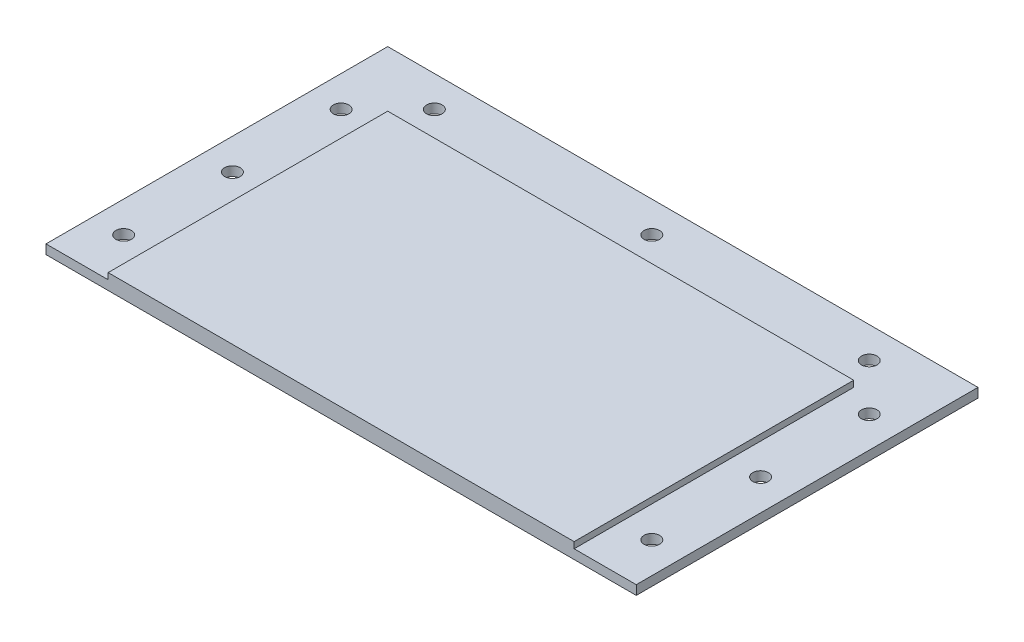
ISO-10303-21;
HEADER;
FILE_DESCRIPTION(('STEP AP214'),'2;1');
FILE_NAME('part.step','',(''),(''),'','','');
FILE_SCHEMA(('AUTOMOTIVE_DESIGN { 1 0 10303 214 1 1 1 1 }'));
ENDSEC;
DATA;
#1=APPLICATION_CONTEXT('core data for automotive mechanical design processes');
#2=APPLICATION_PROTOCOL_DEFINITION('international standard','automotive_design',2000,#1);
#3=PRODUCT_CONTEXT('',#1,'mechanical');
#4=PRODUCT('Part','Part','',(#3));
#5=PRODUCT_RELATED_PRODUCT_CATEGORY('part','',(#4));
#6=PRODUCT_DEFINITION_FORMATION('','',#4);
#7=PRODUCT_DEFINITION_CONTEXT('part definition',#1,'design');
#8=PRODUCT_DEFINITION('design','',#6,#7);
#9=PRODUCT_DEFINITION_SHAPE('','',#8);
#10=(LENGTH_UNIT() NAMED_UNIT(*) SI_UNIT(.MILLI.,.METRE.));
#11=(NAMED_UNIT(*) PLANE_ANGLE_UNIT() SI_UNIT($,.RADIAN.));
#12=(NAMED_UNIT(*) SI_UNIT($,.STERADIAN.) SOLID_ANGLE_UNIT());
#13=UNCERTAINTY_MEASURE_WITH_UNIT(LENGTH_MEASURE(1.E-05),#10,'distance_accuracy_value','');
#14=(GEOMETRIC_REPRESENTATION_CONTEXT(3) GLOBAL_UNCERTAINTY_ASSIGNED_CONTEXT((#13)) GLOBAL_UNIT_ASSIGNED_CONTEXT((#10,
#11,#12)) REPRESENTATION_CONTEXT('',''));
#15=CARTESIAN_POINT('',(0.,0.,0.));
#16=DIRECTION('',(0.,0.,1.));
#17=DIRECTION('',(1.,0.,0.));
#18=AXIS2_PLACEMENT_3D('',#15,#16,#17);
#19=CARTESIAN_POINT('',(0.,0.,0.));
#20=DIRECTION('',(0.,1.,0.));
#21=DIRECTION('',(0.,0.,1.));
#22=AXIS2_PLACEMENT_3D('',#19,#20,#21);
#23=PLANE('',#22);
#24=CARTESIAN_POINT('',(70.0000000000004,0.,-54.9999999999994));
#25=DIRECTION('',(0.,-1.,0.));
#26=DIRECTION('',(0.,0.,-1.));
#27=AXIS2_PLACEMENT_3D('',#24,#25,#26);
#28=CIRCLE('',#27,2.49999999999952);
#29=CARTESIAN_POINT('',(70.0000000000004,0.,-57.4999999999989));
#30=VERTEX_POINT('',#29);
#31=EDGE_CURVE('E317',#30,#30,#28,.T.);
#32=ORIENTED_EDGE('',*,*,#31,.F.);
#33=EDGE_LOOP('',(#32));
#34=FACE_BOUND('',#33,.T.);
#35=CARTESIAN_POINT('',(-84.9999999999994,0.,-39.9999999999999));
#36=DIRECTION('',(0.,-1.,0.));
#37=DIRECTION('',(0.,0.,-1.));
#38=AXIS2_PLACEMENT_3D('',#35,#36,#37);
#39=CIRCLE('',#38,2.50000000000001);
#40=CARTESIAN_POINT('',(-84.9999999999994,0.,-42.4999999999999));
#41=VERTEX_POINT('',#40);
#42=EDGE_CURVE('E320',#41,#41,#39,.T.);
#43=ORIENTED_EDGE('',*,*,#42,.F.);
#44=EDGE_LOOP('',(#43));
#45=FACE_BOUND('',#44,.T.);
#46=CARTESIAN_POINT('',(-84.9999999999998,0.,-4.99999999999999));
#47=DIRECTION('',(0.,-1.,0.));
#48=DIRECTION('',(0.,0.,-1.));
#49=AXIS2_PLACEMENT_3D('',#46,#47,#48);
#50=CIRCLE('',#49,2.50000000000001);
#51=CARTESIAN_POINT('',(-84.9999999999998,0.,-7.5));
#52=VERTEX_POINT('',#51);
#53=EDGE_CURVE('E306',#52,#52,#50,.T.);
#54=ORIENTED_EDGE('',*,*,#53,.F.);
#55=EDGE_LOOP('',(#54));
#56=FACE_BOUND('',#55,.T.);
#57=CARTESIAN_POINT('',(-84.9999999999999,0.,30.));
#58=DIRECTION('',(0.,-1.,0.));
#59=DIRECTION('',(0.,0.,-1.));
#60=AXIS2_PLACEMENT_3D('',#57,#58,#59);
#61=CIRCLE('',#60,2.5);
#62=CARTESIAN_POINT('',(-84.9999999999999,0.,27.5));
#63=VERTEX_POINT('',#62);
#64=EDGE_CURVE('E302',#63,#63,#61,.T.);
#65=ORIENTED_EDGE('',*,*,#64,.F.);
#66=EDGE_LOOP('',(#65));
#67=FACE_BOUND('',#66,.T.);
#68=CARTESIAN_POINT('',(7.21644966006352E-13,0.,-54.9999999999993));
#69=DIRECTION('',(0.,-1.,0.));
#70=DIRECTION('',(0.,0.,-1.));
#71=AXIS2_PLACEMENT_3D('',#68,#69,#70);
#72=CIRCLE('',#71,2.50000000000001);
#73=CARTESIAN_POINT('',(7.21644966006352E-13,0.,-57.4999999999993));
#74=VERTEX_POINT('',#73);
#75=EDGE_CURVE('E300',#74,#74,#72,.T.);
#76=ORIENTED_EDGE('',*,*,#75,.F.);
#77=EDGE_LOOP('',(#76));
#78=FACE_BOUND('',#77,.T.);
#79=CARTESIAN_POINT('',(-69.9999999999993,0.,-55.0000000000004));
#80=DIRECTION('',(0.,-1.,0.));
#81=DIRECTION('',(0.,0.,-1.));
#82=AXIS2_PLACEMENT_3D('',#79,#80,#81);
#83=CIRCLE('',#82,2.5);
#84=CARTESIAN_POINT('',(-69.9999999999993,0.,-57.5000000000004));
#85=VERTEX_POINT('',#84);
#86=EDGE_CURVE('E303',#85,#85,#83,.T.);
#87=ORIENTED_EDGE('',*,*,#86,.F.);
#88=EDGE_LOOP('',(#87));
#89=FACE_BOUND('',#88,.T.);
#90=CARTESIAN_POINT('',(85.0000000000004,0.,-5.));
#91=DIRECTION('',(0.,-1.,0.));
#92=DIRECTION('',(0.,0.,-1.));
#93=AXIS2_PLACEMENT_3D('',#90,#91,#92);
#94=CIRCLE('',#93,2.50000000000001);
#95=CARTESIAN_POINT('',(85.0000000000004,0.,-7.50000000000001));
#96=VERTEX_POINT('',#95);
#97=EDGE_CURVE('E309',#96,#96,#94,.T.);
#98=ORIENTED_EDGE('',*,*,#97,.F.);
#99=EDGE_LOOP('',(#98));
#100=FACE_BOUND('',#99,.T.);
#101=CARTESIAN_POINT('',(85.,0.,-40.));
#102=DIRECTION('',(0.,-1.,0.));
#103=DIRECTION('',(0.,0.,-1.));
#104=AXIS2_PLACEMENT_3D('',#101,#102,#103);
#105=CIRCLE('',#104,2.5);
#106=CARTESIAN_POINT('',(85.,0.,-42.5));
#107=VERTEX_POINT('',#106);
#108=EDGE_CURVE('E314',#107,#107,#105,.T.);
#109=ORIENTED_EDGE('',*,*,#108,.F.);
#110=EDGE_LOOP('',(#109));
#111=FACE_BOUND('',#110,.T.);
#112=CARTESIAN_POINT('',(85.,0.,30.));
#113=DIRECTION('',(0.,-1.,0.));
#114=DIRECTION('',(0.,0.,-1.));
#115=AXIS2_PLACEMENT_3D('',#112,#113,#114);
#116=CIRCLE('',#115,2.50000000000001);
#117=CARTESIAN_POINT('',(85.,0.,27.5));
#118=VERTEX_POINT('',#117);
#119=EDGE_CURVE('E173',#118,#118,#116,.T.);
#120=ORIENTED_EDGE('',*,*,#119,.F.);
#121=EDGE_LOOP('',(#120));
#122=FACE_BOUND('',#121,.T.);
#123=DIRECTION('',(1.,0.,0.));
#124=VECTOR('',#123,1.);
#125=CARTESIAN_POINT('',(0.,0.,45.));
#126=LINE('',#125,#124);
#127=CARTESIAN_POINT('',(-95.,0.,45.));
#128=VERTEX_POINT('',#127);
#129=CARTESIAN_POINT('',(95.,0.,45.));
#130=VERTEX_POINT('',#129);
#131=EDGE_CURVE('E145',#128,#130,#126,.T.);
#132=ORIENTED_EDGE('',*,*,#131,.F.);
#133=DIRECTION('',(0.,0.,-1.));
#134=VECTOR('',#133,1.);
#135=CARTESIAN_POINT('',(-95.,0.,0.));
#136=LINE('',#135,#134);
#137=CARTESIAN_POINT('',(-95.,0.,-65.));
#138=VERTEX_POINT('',#137);
#139=EDGE_CURVE('E140',#128,#138,#136,.T.);
#140=ORIENTED_EDGE('',*,*,#139,.T.);
#141=DIRECTION('',(1.,0.,0.));
#142=VECTOR('',#141,1.);
#143=CARTESIAN_POINT('',(0.,0.,-65.));
#144=LINE('',#143,#142);
#145=CARTESIAN_POINT('',(95.,0.,-65.));
#146=VERTEX_POINT('',#145);
#147=EDGE_CURVE('E198',#138,#146,#144,.T.);
#148=ORIENTED_EDGE('',*,*,#147,.T.);
#149=DIRECTION('',(0.,0.,-1.));
#150=VECTOR('',#149,1.);
#151=CARTESIAN_POINT('',(95.,0.,0.));
#152=LINE('',#151,#150);
#153=EDGE_CURVE('E195',#130,#146,#152,.T.);
#154=ORIENTED_EDGE('',*,*,#153,.F.);
#155=EDGE_LOOP('',(#132,#140,#148,#154));
#156=FACE_BOUND('',#155,.T.);
#157=ADVANCED_FACE('F57',(#34,#45,#56,#67,#78,#89,#100,#111,#122,#156),#23,.F.);
#158=CARTESIAN_POINT('',(-75.,5.,0.));
#159=DIRECTION('',(1.,0.,0.));
#160=DIRECTION('',(0.,0.,-1.));
#161=AXIS2_PLACEMENT_3D('',#158,#159,#160);
#162=PLANE('',#161);
#163=DIRECTION('',(0.,-1.,0.));
#164=VECTOR('',#163,1.);
#165=CARTESIAN_POINT('',(-75.,5.,-45.));
#166=LINE('',#165,#164);
#167=CARTESIAN_POINT('',(-75.,5.,-45.));
#168=VERTEX_POINT('',#167);
#169=CARTESIAN_POINT('',(-75.,3.,-45.));
#170=VERTEX_POINT('',#169);
#171=EDGE_CURVE('E66',#168,#170,#166,.T.);
#172=ORIENTED_EDGE('',*,*,#171,.T.);
#173=DIRECTION('',(0.,0.,1.));
#174=VECTOR('',#173,1.);
#175=CARTESIAN_POINT('',(-75.,3.,0.));
#176=LINE('',#175,#174);
#177=CARTESIAN_POINT('',(-75.,3.,45.));
#178=VERTEX_POINT('',#177);
#179=EDGE_CURVE('E223',#170,#178,#176,.T.);
#180=ORIENTED_EDGE('',*,*,#179,.T.);
#181=DIRECTION('',(0.,-1.,0.));
#182=VECTOR('',#181,1.);
#183=CARTESIAN_POINT('',(-75.,5.,45.));
#184=LINE('',#183,#182);
#185=CARTESIAN_POINT('',(-75.,5.,45.));
#186=VERTEX_POINT('',#185);
#187=EDGE_CURVE('E165',#186,#178,#184,.T.);
#188=ORIENTED_EDGE('',*,*,#187,.F.);
#189=DIRECTION('',(0.,0.,1.));
#190=VECTOR('',#189,1.);
#191=CARTESIAN_POINT('',(-75.,5.,0.));
#192=LINE('',#191,#190);
#193=EDGE_CURVE('E159',#168,#186,#192,.T.);
#194=ORIENTED_EDGE('',*,*,#193,.F.);
#195=EDGE_LOOP('',(#172,#180,#188,#194));
#196=FACE_BOUND('',#195,.T.);
#197=ADVANCED_FACE('F228',(#196),#162,.F.);
#198=CARTESIAN_POINT('',(0.,5.,-45.));
#199=DIRECTION('',(0.,0.,-1.));
#200=DIRECTION('',(-1.,0.,0.));
#201=AXIS2_PLACEMENT_3D('',#198,#199,#200);
#202=PLANE('',#201);
#203=DIRECTION('',(1.,0.,0.));
#204=VECTOR('',#203,1.);
#205=CARTESIAN_POINT('',(0.,3.,-45.));
#206=LINE('',#205,#204);
#207=CARTESIAN_POINT('',(75.,3.,-45.));
#208=VERTEX_POINT('',#207);
#209=EDGE_CURVE('E73',#170,#208,#206,.T.);
#210=ORIENTED_EDGE('',*,*,#209,.F.);
#211=ORIENTED_EDGE('',*,*,#171,.F.);
#212=DIRECTION('',(1.,0.,0.));
#213=VECTOR('',#212,1.);
#214=CARTESIAN_POINT('',(0.,5.,-45.));
#215=LINE('',#214,#213);
#216=CARTESIAN_POINT('',(75.,5.,-45.));
#217=VERTEX_POINT('',#216);
#218=EDGE_CURVE('E156',#168,#217,#215,.T.);
#219=ORIENTED_EDGE('',*,*,#218,.T.);
#220=DIRECTION('',(0.,-1.,0.));
#221=VECTOR('',#220,1.);
#222=CARTESIAN_POINT('',(75.,5.,-45.));
#223=LINE('',#222,#221);
#224=EDGE_CURVE('E12',#217,#208,#223,.T.);
#225=ORIENTED_EDGE('',*,*,#224,.T.);
#226=EDGE_LOOP('',(#210,#211,#219,#225));
#227=FACE_BOUND('',#226,.T.);
#228=ADVANCED_FACE('F231',(#227),#202,.T.);
#229=CARTESIAN_POINT('',(75.,5.,0.));
#230=DIRECTION('',(1.,0.,0.));
#231=DIRECTION('',(0.,0.,-1.));
#232=AXIS2_PLACEMENT_3D('',#229,#230,#231);
#233=PLANE('',#232);
#234=DIRECTION('',(0.,0.,1.));
#235=VECTOR('',#234,1.);
#236=CARTESIAN_POINT('',(75.,3.,0.));
#237=LINE('',#236,#235);
#238=CARTESIAN_POINT('',(75.,3.,45.));
#239=VERTEX_POINT('',#238);
#240=EDGE_CURVE('E81',#208,#239,#237,.T.);
#241=ORIENTED_EDGE('',*,*,#240,.F.);
#242=ORIENTED_EDGE('',*,*,#224,.F.);
#243=DIRECTION('',(0.,0.,1.));
#244=VECTOR('',#243,1.);
#245=CARTESIAN_POINT('',(75.,5.,0.));
#246=LINE('',#245,#244);
#247=CARTESIAN_POINT('',(75.,5.,45.));
#248=VERTEX_POINT('',#247);
#249=EDGE_CURVE('E148',#217,#248,#246,.T.);
#250=ORIENTED_EDGE('',*,*,#249,.T.);
#251=DIRECTION('',(0.,-1.,0.));
#252=VECTOR('',#251,1.);
#253=CARTESIAN_POINT('',(75.,5.,45.));
#254=LINE('',#253,#252);
#255=EDGE_CURVE('E162',#248,#239,#254,.T.);
#256=ORIENTED_EDGE('',*,*,#255,.T.);
#257=EDGE_LOOP('',(#241,#242,#250,#256));
#258=FACE_BOUND('',#257,.T.);
#259=ADVANCED_FACE('F59',(#258),#233,.T.);
#260=CARTESIAN_POINT('',(0.,5.,45.));
#261=DIRECTION('',(0.,0.,-1.));
#262=DIRECTION('',(-1.,0.,0.));
#263=AXIS2_PLACEMENT_3D('',#260,#261,#262);
#264=PLANE('',#263);
#265=ORIENTED_EDGE('',*,*,#131,.T.);
#266=DIRECTION('',(0.,-1.,0.));
#267=VECTOR('',#266,1.);
#268=CARTESIAN_POINT('',(95.,3.,45.));
#269=LINE('',#268,#267);
#270=CARTESIAN_POINT('',(95.,3.,45.));
#271=VERTEX_POINT('',#270);
#272=EDGE_CURVE('E128',#271,#130,#269,.T.);
#273=ORIENTED_EDGE('',*,*,#272,.F.);
#274=DIRECTION('',(1.,0.,0.));
#275=VECTOR('',#274,1.);
#276=CARTESIAN_POINT('',(0.,3.,45.));
#277=LINE('',#276,#275);
#278=EDGE_CURVE('E134',#239,#271,#277,.T.);
#279=ORIENTED_EDGE('',*,*,#278,.F.);
#280=ORIENTED_EDGE('',*,*,#255,.F.);
#281=DIRECTION('',(1.,0.,0.));
#282=VECTOR('',#281,1.);
#283=CARTESIAN_POINT('',(0.,5.,45.));
#284=LINE('',#283,#282);
#285=EDGE_CURVE('E161',#186,#248,#284,.T.);
#286=ORIENTED_EDGE('',*,*,#285,.F.);
#287=ORIENTED_EDGE('',*,*,#187,.T.);
#288=CARTESIAN_POINT('',(-95.,3.,45.));
#289=VERTEX_POINT('',#288);
#290=EDGE_CURVE('E142',#289,#178,#277,.T.);
#291=ORIENTED_EDGE('',*,*,#290,.F.);
#292=DIRECTION('',(0.,-1.,0.));
#293=VECTOR('',#292,1.);
#294=CARTESIAN_POINT('',(-95.,3.,45.));
#295=LINE('',#294,#293);
#296=EDGE_CURVE('E207',#289,#128,#295,.T.);
#297=ORIENTED_EDGE('',*,*,#296,.T.);
#298=EDGE_LOOP('',(#265,#273,#279,#280,#286,#287,#291,#297));
#299=FACE_BOUND('',#298,.T.);
#300=ADVANCED_FACE('F143',(#299),#264,.F.);
#301=CARTESIAN_POINT('',(0.,5.,0.));
#302=DIRECTION('',(0.,1.,0.));
#303=DIRECTION('',(0.,0.,1.));
#304=AXIS2_PLACEMENT_3D('',#301,#302,#303);
#305=PLANE('',#304);
#306=ORIENTED_EDGE('',*,*,#249,.F.);
#307=ORIENTED_EDGE('',*,*,#218,.F.);
#308=ORIENTED_EDGE('',*,*,#193,.T.);
#309=ORIENTED_EDGE('',*,*,#285,.T.);
#310=EDGE_LOOP('',(#306,#307,#308,#309));
#311=FACE_BOUND('',#310,.T.);
#312=ADVANCED_FACE('F234',(#311),#305,.T.);
#313=CARTESIAN_POINT('',(95.,3.,0.));
#314=DIRECTION('',(-1.,0.,0.));
#315=DIRECTION('',(0.,0.,1.));
#316=AXIS2_PLACEMENT_3D('',#313,#314,#315);
#317=PLANE('',#316);
#318=ORIENTED_EDGE('',*,*,#153,.T.);
#319=DIRECTION('',(0.,-1.,0.));
#320=VECTOR('',#319,1.);
#321=CARTESIAN_POINT('',(95.,3.,-65.));
#322=LINE('',#321,#320);
#323=CARTESIAN_POINT('',(95.,3.,-65.));
#324=VERTEX_POINT('',#323);
#325=EDGE_CURVE('E129',#324,#146,#322,.T.);
#326=ORIENTED_EDGE('',*,*,#325,.F.);
#327=DIRECTION('',(0.,0.,-1.));
#328=VECTOR('',#327,1.);
#329=CARTESIAN_POINT('',(95.,3.,0.));
#330=LINE('',#329,#328);
#331=EDGE_CURVE('E123',#271,#324,#330,.T.);
#332=ORIENTED_EDGE('',*,*,#331,.F.);
#333=ORIENTED_EDGE('',*,*,#272,.T.);
#334=EDGE_LOOP('',(#318,#326,#332,#333));
#335=FACE_BOUND('',#334,.T.);
#336=ADVANCED_FACE('F126',(#335),#317,.F.);
#337=CARTESIAN_POINT('',(0.,3.,-65.));
#338=DIRECTION('',(0.,0.,-1.));
#339=DIRECTION('',(-1.,0.,0.));
#340=AXIS2_PLACEMENT_3D('',#337,#338,#339);
#341=PLANE('',#340);
#342=ORIENTED_EDGE('',*,*,#147,.F.);
#343=DIRECTION('',(0.,-1.,0.));
#344=VECTOR('',#343,1.);
#345=CARTESIAN_POINT('',(-95.,3.,-65.));
#346=LINE('',#345,#344);
#347=CARTESIAN_POINT('',(-95.,3.,-65.));
#348=VERTEX_POINT('',#347);
#349=EDGE_CURVE('E150',#348,#138,#346,.T.);
#350=ORIENTED_EDGE('',*,*,#349,.F.);
#351=DIRECTION('',(1.,0.,0.));
#352=VECTOR('',#351,1.);
#353=CARTESIAN_POINT('',(0.,3.,-65.));
#354=LINE('',#353,#352);
#355=EDGE_CURVE('E133',#348,#324,#354,.T.);
#356=ORIENTED_EDGE('',*,*,#355,.T.);
#357=ORIENTED_EDGE('',*,*,#325,.T.);
#358=EDGE_LOOP('',(#342,#350,#356,#357));
#359=FACE_BOUND('',#358,.T.);
#360=ADVANCED_FACE('F216',(#359),#341,.T.);
#361=CARTESIAN_POINT('',(-95.,3.,0.));
#362=DIRECTION('',(-1.,0.,0.));
#363=DIRECTION('',(0.,0.,1.));
#364=AXIS2_PLACEMENT_3D('',#361,#362,#363);
#365=PLANE('',#364);
#366=ORIENTED_EDGE('',*,*,#139,.F.);
#367=ORIENTED_EDGE('',*,*,#296,.F.);
#368=DIRECTION('',(0.,0.,-1.));
#369=VECTOR('',#368,1.);
#370=CARTESIAN_POINT('',(-95.,3.,0.));
#371=LINE('',#370,#369);
#372=EDGE_CURVE('E214',#289,#348,#371,.T.);
#373=ORIENTED_EDGE('',*,*,#372,.T.);
#374=ORIENTED_EDGE('',*,*,#349,.T.);
#375=EDGE_LOOP('',(#366,#367,#373,#374));
#376=FACE_BOUND('',#375,.T.);
#377=ADVANCED_FACE('F212',(#376),#365,.T.);
#378=CARTESIAN_POINT('',(0.,3.,0.));
#379=DIRECTION('',(0.,1.,0.));
#380=DIRECTION('',(0.,0.,1.));
#381=AXIS2_PLACEMENT_3D('',#378,#379,#380);
#382=PLANE('',#381);
#383=CARTESIAN_POINT('',(70.0000000000004,3.,-54.9999999999994));
#384=DIRECTION('',(0.,1.,0.));
#385=DIRECTION('',(0.,0.,1.));
#386=AXIS2_PLACEMENT_3D('',#383,#384,#385);
#387=CIRCLE('',#386,2.49999999999952);
#388=CARTESIAN_POINT('',(70.0000000000004,3.,-52.4999999999999));
#389=VERTEX_POINT('',#388);
#390=EDGE_CURVE('E61',#389,#389,#387,.T.);
#391=ORIENTED_EDGE('',*,*,#390,.F.);
#392=EDGE_LOOP('',(#391));
#393=FACE_BOUND('',#392,.T.);
#394=CARTESIAN_POINT('',(-84.9999999999994,3.,-39.9999999999999));
#395=DIRECTION('',(0.,1.,0.));
#396=DIRECTION('',(0.,0.,1.));
#397=AXIS2_PLACEMENT_3D('',#394,#395,#396);
#398=CIRCLE('',#397,2.50000000000001);
#399=CARTESIAN_POINT('',(-84.9999999999994,3.,-37.4999999999999));
#400=VERTEX_POINT('',#399);
#401=EDGE_CURVE('E190',#400,#400,#398,.T.);
#402=ORIENTED_EDGE('',*,*,#401,.F.);
#403=EDGE_LOOP('',(#402));
#404=FACE_BOUND('',#403,.T.);
#405=CARTESIAN_POINT('',(-84.9999999999998,3.,-4.99999999999999));
#406=DIRECTION('',(0.,1.,0.));
#407=DIRECTION('',(0.,0.,1.));
#408=AXIS2_PLACEMENT_3D('',#405,#406,#407);
#409=CIRCLE('',#408,2.50000000000001);
#410=CARTESIAN_POINT('',(-84.9999999999998,3.,-2.49999999999998));
#411=VERTEX_POINT('',#410);
#412=EDGE_CURVE('E188',#411,#411,#409,.T.);
#413=ORIENTED_EDGE('',*,*,#412,.F.);
#414=EDGE_LOOP('',(#413));
#415=FACE_BOUND('',#414,.T.);
#416=CARTESIAN_POINT('',(-84.9999999999999,3.,30.));
#417=DIRECTION('',(0.,1.,0.));
#418=DIRECTION('',(0.,0.,1.));
#419=AXIS2_PLACEMENT_3D('',#416,#417,#418);
#420=CIRCLE('',#419,2.5);
#421=CARTESIAN_POINT('',(-84.9999999999999,3.,32.5));
#422=VERTEX_POINT('',#421);
#423=EDGE_CURVE('E185',#422,#422,#420,.T.);
#424=ORIENTED_EDGE('',*,*,#423,.F.);
#425=EDGE_LOOP('',(#424));
#426=FACE_BOUND('',#425,.T.);
#427=CARTESIAN_POINT('',(7.21644966006352E-13,3.,-54.9999999999993));
#428=DIRECTION('',(0.,1.,0.));
#429=DIRECTION('',(0.,0.,1.));
#430=AXIS2_PLACEMENT_3D('',#427,#428,#429);
#431=CIRCLE('',#430,2.50000000000001);
#432=CARTESIAN_POINT('',(7.21644966006352E-13,3.,-52.4999999999993));
#433=VERTEX_POINT('',#432);
#434=EDGE_CURVE('E182',#433,#433,#431,.T.);
#435=ORIENTED_EDGE('',*,*,#434,.F.);
#436=EDGE_LOOP('',(#435));
#437=FACE_BOUND('',#436,.T.);
#438=CARTESIAN_POINT('',(-69.9999999999993,3.,-55.0000000000004));
#439=DIRECTION('',(0.,1.,0.));
#440=DIRECTION('',(0.,0.,1.));
#441=AXIS2_PLACEMENT_3D('',#438,#439,#440);
#442=CIRCLE('',#441,2.5);
#443=CARTESIAN_POINT('',(-69.9999999999993,3.,-52.5000000000004));
#444=VERTEX_POINT('',#443);
#445=EDGE_CURVE('E179',#444,#444,#442,.T.);
#446=ORIENTED_EDGE('',*,*,#445,.F.);
#447=EDGE_LOOP('',(#446));
#448=FACE_BOUND('',#447,.T.);
#449=CARTESIAN_POINT('',(85.0000000000004,3.,-5.));
#450=DIRECTION('',(0.,1.,0.));
#451=DIRECTION('',(0.,0.,1.));
#452=AXIS2_PLACEMENT_3D('',#449,#450,#451);
#453=CIRCLE('',#452,2.50000000000001);
#454=CARTESIAN_POINT('',(85.0000000000004,3.,-2.49999999999999));
#455=VERTEX_POINT('',#454);
#456=EDGE_CURVE('E176',#455,#455,#453,.T.);
#457=ORIENTED_EDGE('',*,*,#456,.F.);
#458=EDGE_LOOP('',(#457));
#459=FACE_BOUND('',#458,.T.);
#460=CARTESIAN_POINT('',(85.,3.,-40.));
#461=DIRECTION('',(0.,1.,0.));
#462=DIRECTION('',(0.,0.,1.));
#463=AXIS2_PLACEMENT_3D('',#460,#461,#462);
#464=CIRCLE('',#463,2.5);
#465=CARTESIAN_POINT('',(85.,3.,-37.5));
#466=VERTEX_POINT('',#465);
#467=EDGE_CURVE('E172',#466,#466,#464,.T.);
#468=ORIENTED_EDGE('',*,*,#467,.F.);
#469=EDGE_LOOP('',(#468));
#470=FACE_BOUND('',#469,.T.);
#471=CARTESIAN_POINT('',(85.,3.,30.));
#472=DIRECTION('',(0.,1.,0.));
#473=DIRECTION('',(0.,0.,1.));
#474=AXIS2_PLACEMENT_3D('',#471,#472,#473);
#475=CIRCLE('',#474,2.50000000000001);
#476=CARTESIAN_POINT('',(85.,3.,32.5));
#477=VERTEX_POINT('',#476);
#478=EDGE_CURVE('E169',#477,#477,#475,.T.);
#479=ORIENTED_EDGE('',*,*,#478,.F.);
#480=EDGE_LOOP('',(#479));
#481=FACE_BOUND('',#480,.T.);
#482=ORIENTED_EDGE('',*,*,#278,.T.);
#483=ORIENTED_EDGE('',*,*,#331,.T.);
#484=ORIENTED_EDGE('',*,*,#355,.F.);
#485=ORIENTED_EDGE('',*,*,#372,.F.);
#486=ORIENTED_EDGE('',*,*,#290,.T.);
#487=ORIENTED_EDGE('',*,*,#179,.F.);
#488=ORIENTED_EDGE('',*,*,#209,.T.);
#489=ORIENTED_EDGE('',*,*,#240,.T.);
#490=EDGE_LOOP('',(#482,#483,#484,#485,#486,#487,#488,#489));
#491=FACE_BOUND('',#490,.T.);
#492=ADVANCED_FACE('F137',(#393,#404,#415,#426,#437,#448,#459,#470,#481,#491),#382,.T.);
#493=CARTESIAN_POINT('',(85.,10.,30.));
#494=DIRECTION('',(0.,-1.,0.));
#495=DIRECTION('',(0.,0.,-1.));
#496=AXIS2_PLACEMENT_3D('',#493,#494,#495);
#497=CYLINDRICAL_SURFACE('',#496,2.50000000000001);
#498=ORIENTED_EDGE('',*,*,#478,.T.);
#499=EDGE_LOOP('',(#498));
#500=FACE_BOUND('',#499,.T.);
#501=ORIENTED_EDGE('',*,*,#119,.T.);
#502=EDGE_LOOP('',(#501));
#503=FACE_BOUND('',#502,.T.);
#504=ADVANCED_FACE('F260',(#500,#503),#497,.F.);
#505=CARTESIAN_POINT('',(85.,10.,-40.));
#506=DIRECTION('',(0.,-1.,0.));
#507=DIRECTION('',(0.,0.,-1.));
#508=AXIS2_PLACEMENT_3D('',#505,#506,#507);
#509=CYLINDRICAL_SURFACE('',#508,2.5);
#510=ORIENTED_EDGE('',*,*,#467,.T.);
#511=EDGE_LOOP('',(#510));
#512=FACE_BOUND('',#511,.T.);
#513=ORIENTED_EDGE('',*,*,#108,.T.);
#514=EDGE_LOOP('',(#513));
#515=FACE_BOUND('',#514,.T.);
#516=ADVANCED_FACE('F264',(#512,#515),#509,.F.);
#517=CARTESIAN_POINT('',(85.0000000000004,10.,-5.));
#518=DIRECTION('',(0.,-1.,0.));
#519=DIRECTION('',(0.,0.,-1.));
#520=AXIS2_PLACEMENT_3D('',#517,#518,#519);
#521=CYLINDRICAL_SURFACE('',#520,2.50000000000001);
#522=ORIENTED_EDGE('',*,*,#456,.T.);
#523=EDGE_LOOP('',(#522));
#524=FACE_BOUND('',#523,.T.);
#525=ORIENTED_EDGE('',*,*,#97,.T.);
#526=EDGE_LOOP('',(#525));
#527=FACE_BOUND('',#526,.T.);
#528=ADVANCED_FACE('F283',(#524,#527),#521,.F.);
#529=CARTESIAN_POINT('',(-69.9999999999993,10.,-55.0000000000004));
#530=DIRECTION('',(0.,-1.,0.));
#531=DIRECTION('',(0.,0.,-1.));
#532=AXIS2_PLACEMENT_3D('',#529,#530,#531);
#533=CYLINDRICAL_SURFACE('',#532,2.5);
#534=ORIENTED_EDGE('',*,*,#445,.T.);
#535=EDGE_LOOP('',(#534));
#536=FACE_BOUND('',#535,.T.);
#537=ORIENTED_EDGE('',*,*,#86,.T.);
#538=EDGE_LOOP('',(#537));
#539=FACE_BOUND('',#538,.T.);
#540=ADVANCED_FACE('F287',(#536,#539),#533,.F.);
#541=CARTESIAN_POINT('',(7.21644966006352E-13,10.,-54.9999999999993));
#542=DIRECTION('',(0.,-1.,0.));
#543=DIRECTION('',(0.,0.,-1.));
#544=AXIS2_PLACEMENT_3D('',#541,#542,#543);
#545=CYLINDRICAL_SURFACE('',#544,2.50000000000001);
#546=ORIENTED_EDGE('',*,*,#434,.T.);
#547=EDGE_LOOP('',(#546));
#548=FACE_BOUND('',#547,.T.);
#549=ORIENTED_EDGE('',*,*,#75,.T.);
#550=EDGE_LOOP('',(#549));
#551=FACE_BOUND('',#550,.T.);
#552=ADVANCED_FACE('F270',(#548,#551),#545,.F.);
#553=CARTESIAN_POINT('',(-84.9999999999999,10.,30.));
#554=DIRECTION('',(0.,-1.,0.));
#555=DIRECTION('',(0.,0.,-1.));
#556=AXIS2_PLACEMENT_3D('',#553,#554,#555);
#557=CYLINDRICAL_SURFACE('',#556,2.5);
#558=ORIENTED_EDGE('',*,*,#423,.T.);
#559=EDGE_LOOP('',(#558));
#560=FACE_BOUND('',#559,.T.);
#561=ORIENTED_EDGE('',*,*,#64,.T.);
#562=EDGE_LOOP('',(#561));
#563=FACE_BOUND('',#562,.T.);
#564=ADVANCED_FACE('F266',(#560,#563),#557,.F.);
#565=CARTESIAN_POINT('',(-84.9999999999998,10.,-4.99999999999999));
#566=DIRECTION('',(0.,-1.,0.));
#567=DIRECTION('',(0.,0.,-1.));
#568=AXIS2_PLACEMENT_3D('',#565,#566,#567);
#569=CYLINDRICAL_SURFACE('',#568,2.50000000000001);
#570=ORIENTED_EDGE('',*,*,#412,.T.);
#571=EDGE_LOOP('',(#570));
#572=FACE_BOUND('',#571,.T.);
#573=ORIENTED_EDGE('',*,*,#53,.T.);
#574=EDGE_LOOP('',(#573));
#575=FACE_BOUND('',#574,.T.);
#576=ADVANCED_FACE('F269',(#572,#575),#569,.F.);
#577=CARTESIAN_POINT('',(-84.9999999999994,10.,-39.9999999999999));
#578=DIRECTION('',(0.,-1.,0.));
#579=DIRECTION('',(0.,0.,-1.));
#580=AXIS2_PLACEMENT_3D('',#577,#578,#579);
#581=CYLINDRICAL_SURFACE('',#580,2.50000000000001);
#582=ORIENTED_EDGE('',*,*,#401,.T.);
#583=EDGE_LOOP('',(#582));
#584=FACE_BOUND('',#583,.T.);
#585=ORIENTED_EDGE('',*,*,#42,.T.);
#586=EDGE_LOOP('',(#585));
#587=FACE_BOUND('',#586,.T.);
#588=ADVANCED_FACE('F274',(#584,#587),#581,.F.);
#589=CARTESIAN_POINT('',(70.0000000000004,10.,-54.9999999999994));
#590=DIRECTION('',(0.,-1.,0.));
#591=DIRECTION('',(0.,0.,-1.));
#592=AXIS2_PLACEMENT_3D('',#589,#590,#591);
#593=CYLINDRICAL_SURFACE('',#592,2.49999999999952);
#594=ORIENTED_EDGE('',*,*,#390,.T.);
#595=EDGE_LOOP('',(#594));
#596=FACE_BOUND('',#595,.T.);
#597=ORIENTED_EDGE('',*,*,#31,.T.);
#598=EDGE_LOOP('',(#597));
#599=FACE_BOUND('',#598,.T.);
#600=ADVANCED_FACE('F278',(#596,#599),#593,.F.);
#601=CLOSED_SHELL('',(#157,#197,#228,#259,#300,#312,#336,#360,#377,#492,#504,#516,#528,#540,
#552,#564,#576,#588,#600));
#602=MANIFOLD_SOLID_BREP('B2',#601);
#603=ADVANCED_BREP_SHAPE_REPRESENTATION('',(#18,#602),#14);
#604=SHAPE_DEFINITION_REPRESENTATION(#9,#603);
ENDSEC;
END-ISO-10303-21;
